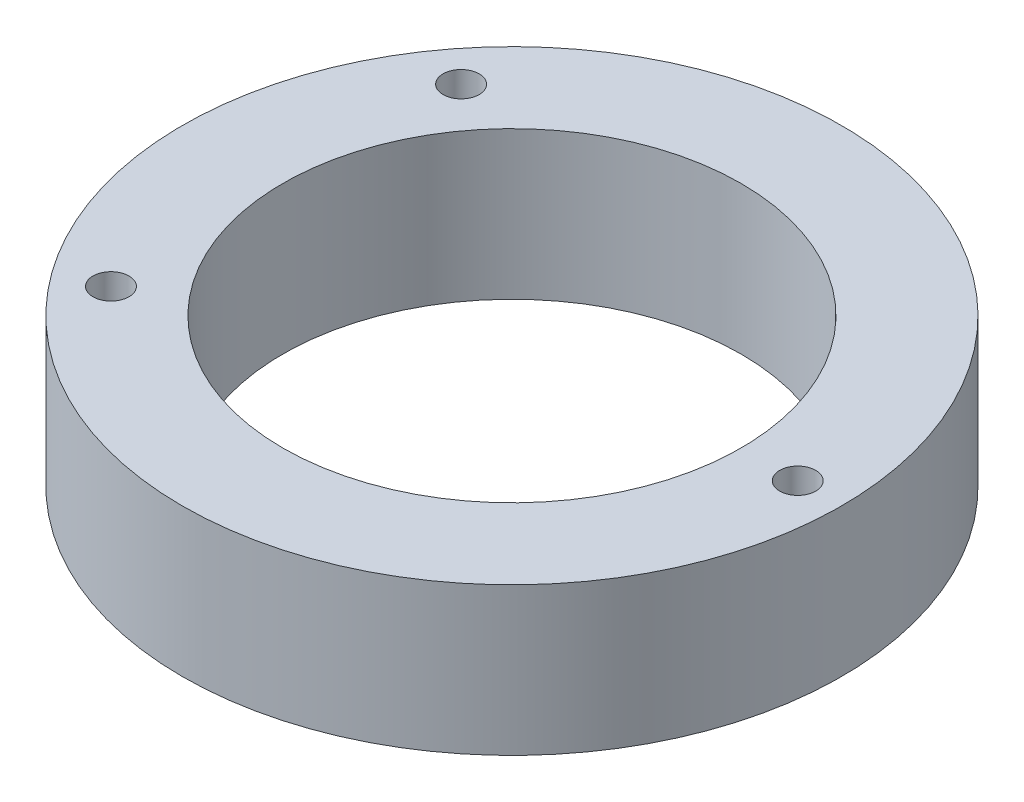
ISO-10303-21;
HEADER;
FILE_DESCRIPTION(('STEP AP214'),'2;1');
FILE_NAME('part.step','',(''),(''),'','','');
FILE_SCHEMA(('AUTOMOTIVE_DESIGN { 1 0 10303 214 1 1 1 1 }'));
ENDSEC;
DATA;
#1=APPLICATION_CONTEXT('core data for automotive mechanical design processes');
#2=APPLICATION_PROTOCOL_DEFINITION('international standard','automotive_design',2000,#1);
#3=PRODUCT_CONTEXT('',#1,'mechanical');
#4=PRODUCT('Part','Part','',(#3));
#5=PRODUCT_RELATED_PRODUCT_CATEGORY('part','',(#4));
#6=PRODUCT_DEFINITION_FORMATION('','',#4);
#7=PRODUCT_DEFINITION_CONTEXT('part definition',#1,'design');
#8=PRODUCT_DEFINITION('design','',#6,#7);
#9=PRODUCT_DEFINITION_SHAPE('','',#8);
#10=(LENGTH_UNIT() NAMED_UNIT(*) SI_UNIT(.MILLI.,.METRE.));
#11=(NAMED_UNIT(*) PLANE_ANGLE_UNIT() SI_UNIT($,.RADIAN.));
#12=(NAMED_UNIT(*) SI_UNIT($,.STERADIAN.) SOLID_ANGLE_UNIT());
#13=UNCERTAINTY_MEASURE_WITH_UNIT(LENGTH_MEASURE(1.E-05),#10,'distance_accuracy_value','');
#14=(GEOMETRIC_REPRESENTATION_CONTEXT(3) GLOBAL_UNCERTAINTY_ASSIGNED_CONTEXT((#13)) GLOBAL_UNIT_ASSIGNED_CONTEXT((#10,
#11,#12)) REPRESENTATION_CONTEXT('',''));
#15=CARTESIAN_POINT('',(0.,0.,0.));
#16=DIRECTION('',(0.,0.,1.));
#17=DIRECTION('',(1.,0.,0.));
#18=AXIS2_PLACEMENT_3D('',#15,#16,#17);
#19=CARTESIAN_POINT('',(0.,14.35,0.));
#20=DIRECTION('',(0.,1.,0.));
#21=DIRECTION('',(0.,0.,1.));
#22=AXIS2_PLACEMENT_3D('',#19,#20,#21);
#23=PLANE('',#22);
#24=CARTESIAN_POINT('',(-21.9327372290304,14.35,17.0005158051837));
#25=DIRECTION('',(0.,1.,0.));
#26=DIRECTION('',(0.,0.,1.));
#27=AXIS2_PLACEMENT_3D('',#24,#25,#26);
#28=CIRCLE('',#27,1.75);
#29=CARTESIAN_POINT('',(-21.9327372290304,14.35,18.7505158051837));
#30=VERTEX_POINT('',#29);
#31=EDGE_CURVE('E53',#30,#30,#28,.T.);
#32=ORIENTED_EDGE('',*,*,#31,.F.);
#33=EDGE_LOOP('',(#32));
#34=FACE_BOUND('',#33,.T.);
#35=CARTESIAN_POINT('',(0.,14.35,0.));
#36=DIRECTION('',(0.,1.,0.));
#37=DIRECTION('',(0.,0.,1.));
#38=AXIS2_PLACEMENT_3D('',#35,#36,#37);
#39=CIRCLE('',#38,22.25);
#40=CARTESIAN_POINT('',(0.,14.35,22.25));
#41=VERTEX_POINT('',#40);
#42=EDGE_CURVE('E42',#41,#41,#39,.T.);
#43=ORIENTED_EDGE('',*,*,#42,.F.);
#44=EDGE_LOOP('',(#43));
#45=FACE_BOUND('',#44,.T.);
#46=CARTESIAN_POINT('',(0.,14.35,0.));
#47=DIRECTION('',(0.,1.,0.));
#48=DIRECTION('',(0.,0.,1.));
#49=AXIS2_PLACEMENT_3D('',#46,#47,#48);
#50=CIRCLE('',#49,32.);
#51=CARTESIAN_POINT('',(0.,14.35,32.));
#52=VERTEX_POINT('',#51);
#53=EDGE_CURVE('E10',#52,#52,#50,.T.);
#54=ORIENTED_EDGE('',*,*,#53,.T.);
#55=EDGE_LOOP('',(#54));
#56=FACE_BOUND('',#55,.T.);
#57=CARTESIAN_POINT('',(27.75,14.35,0.));
#58=DIRECTION('',(0.,1.,0.));
#59=DIRECTION('',(0.,0.,1.));
#60=AXIS2_PLACEMENT_3D('',#57,#58,#59);
#61=CIRCLE('',#60,1.75);
#62=CARTESIAN_POINT('',(27.75,14.35,1.75));
#63=VERTEX_POINT('',#62);
#64=EDGE_CURVE('E47',#63,#63,#61,.T.);
#65=ORIENTED_EDGE('',*,*,#64,.F.);
#66=EDGE_LOOP('',(#65));
#67=FACE_BOUND('',#66,.T.);
#68=CARTESIAN_POINT('',(-21.9327372290304,14.35,-17.0005158051837));
#69=DIRECTION('',(0.,1.,0.));
#70=DIRECTION('',(0.,0.,1.));
#71=AXIS2_PLACEMENT_3D('',#68,#69,#70);
#72=CIRCLE('',#71,1.75);
#73=CARTESIAN_POINT('',(-21.9327372290304,14.35,-15.2505158051838));
#74=VERTEX_POINT('',#73);
#75=EDGE_CURVE('E59',#74,#74,#72,.T.);
#76=ORIENTED_EDGE('',*,*,#75,.F.);
#77=EDGE_LOOP('',(#76));
#78=FACE_BOUND('',#77,.T.);
#79=ADVANCED_FACE('F31',(#34,#45,#56,#67,#78),#23,.T.);
#80=CARTESIAN_POINT('',(0.,0.,0.));
#81=DIRECTION('',(0.,1.,0.));
#82=DIRECTION('',(0.,0.,1.));
#83=AXIS2_PLACEMENT_3D('',#80,#81,#82);
#84=PLANE('',#83);
#85=CARTESIAN_POINT('',(0.,0.,0.));
#86=DIRECTION('',(0.,1.,0.));
#87=DIRECTION('',(0.,0.,1.));
#88=AXIS2_PLACEMENT_3D('',#85,#86,#87);
#89=CIRCLE('',#88,32.);
#90=CARTESIAN_POINT('',(0.,0.,32.));
#91=VERTEX_POINT('',#90);
#92=EDGE_CURVE('E35',#91,#91,#89,.T.);
#93=ORIENTED_EDGE('',*,*,#92,.F.);
#94=EDGE_LOOP('',(#93));
#95=FACE_BOUND('',#94,.T.);
#96=CARTESIAN_POINT('',(0.,0.,0.));
#97=DIRECTION('',(0.,1.,0.));
#98=DIRECTION('',(0.,0.,1.));
#99=AXIS2_PLACEMENT_3D('',#96,#97,#98);
#100=CIRCLE('',#99,22.25);
#101=CARTESIAN_POINT('',(0.,0.,22.25));
#102=VERTEX_POINT('',#101);
#103=EDGE_CURVE('E44',#102,#102,#100,.T.);
#104=ORIENTED_EDGE('',*,*,#103,.T.);
#105=EDGE_LOOP('',(#104));
#106=FACE_BOUND('',#105,.T.);
#107=CARTESIAN_POINT('',(27.75,0.,0.));
#108=DIRECTION('',(0.,1.,0.));
#109=DIRECTION('',(0.,0.,1.));
#110=AXIS2_PLACEMENT_3D('',#107,#108,#109);
#111=CIRCLE('',#110,1.75);
#112=CARTESIAN_POINT('',(27.75,0.,1.75));
#113=VERTEX_POINT('',#112);
#114=EDGE_CURVE('E50',#113,#113,#111,.T.);
#115=ORIENTED_EDGE('',*,*,#114,.T.);
#116=EDGE_LOOP('',(#115));
#117=FACE_BOUND('',#116,.T.);
#118=CARTESIAN_POINT('',(-21.9327372290304,0.,17.0005158051837));
#119=DIRECTION('',(0.,1.,0.));
#120=DIRECTION('',(0.,0.,1.));
#121=AXIS2_PLACEMENT_3D('',#118,#119,#120);
#122=CIRCLE('',#121,1.75);
#123=CARTESIAN_POINT('',(-21.9327372290304,0.,18.7505158051837));
#124=VERTEX_POINT('',#123);
#125=EDGE_CURVE('E56',#124,#124,#122,.T.);
#126=ORIENTED_EDGE('',*,*,#125,.T.);
#127=EDGE_LOOP('',(#126));
#128=FACE_BOUND('',#127,.T.);
#129=CARTESIAN_POINT('',(-21.9327372290304,0.,-17.0005158051837));
#130=DIRECTION('',(0.,1.,0.));
#131=DIRECTION('',(0.,0.,1.));
#132=AXIS2_PLACEMENT_3D('',#129,#130,#131);
#133=CIRCLE('',#132,1.75);
#134=CARTESIAN_POINT('',(-21.9327372290304,0.,-15.2505158051838));
#135=VERTEX_POINT('',#134);
#136=EDGE_CURVE('E62',#135,#135,#133,.T.);
#137=ORIENTED_EDGE('',*,*,#136,.T.);
#138=EDGE_LOOP('',(#137));
#139=FACE_BOUND('',#138,.T.);
#140=ADVANCED_FACE('F72',(#95,#106,#117,#128,#139),#84,.F.);
#141=CARTESIAN_POINT('',(0.,14.35,0.));
#142=DIRECTION('',(0.,-1.,0.));
#143=DIRECTION('',(0.,0.,-1.));
#144=AXIS2_PLACEMENT_3D('',#141,#142,#143);
#145=CYLINDRICAL_SURFACE('',#144,32.);
#146=ORIENTED_EDGE('',*,*,#53,.F.);
#147=EDGE_LOOP('',(#146));
#148=FACE_BOUND('',#147,.T.);
#149=ORIENTED_EDGE('',*,*,#92,.T.);
#150=EDGE_LOOP('',(#149));
#151=FACE_BOUND('',#150,.T.);
#152=ADVANCED_FACE('F33',(#148,#151),#145,.T.);
#153=CARTESIAN_POINT('',(0.,14.35,0.));
#154=DIRECTION('',(0.,-1.,0.));
#155=DIRECTION('',(0.,0.,-1.));
#156=AXIS2_PLACEMENT_3D('',#153,#154,#155);
#157=CYLINDRICAL_SURFACE('',#156,22.25);
#158=ORIENTED_EDGE('',*,*,#42,.T.);
#159=EDGE_LOOP('',(#158));
#160=FACE_BOUND('',#159,.T.);
#161=ORIENTED_EDGE('',*,*,#103,.F.);
#162=EDGE_LOOP('',(#161));
#163=FACE_BOUND('',#162,.T.);
#164=ADVANCED_FACE('F82',(#160,#163),#157,.F.);
#165=CARTESIAN_POINT('',(27.75,14.35,0.));
#166=DIRECTION('',(0.,-1.,0.));
#167=DIRECTION('',(0.,0.,-1.));
#168=AXIS2_PLACEMENT_3D('',#165,#166,#167);
#169=CYLINDRICAL_SURFACE('',#168,1.75);
#170=ORIENTED_EDGE('',*,*,#64,.T.);
#171=EDGE_LOOP('',(#170));
#172=FACE_BOUND('',#171,.T.);
#173=ORIENTED_EDGE('',*,*,#114,.F.);
#174=EDGE_LOOP('',(#173));
#175=FACE_BOUND('',#174,.T.);
#176=ADVANCED_FACE('F85',(#172,#175),#169,.F.);
#177=CARTESIAN_POINT('',(-21.9327372290304,14.35,17.0005158051837));
#178=DIRECTION('',(0.,-1.,0.));
#179=DIRECTION('',(0.,0.,-1.));
#180=AXIS2_PLACEMENT_3D('',#177,#178,#179);
#181=CYLINDRICAL_SURFACE('',#180,1.75);
#182=ORIENTED_EDGE('',*,*,#31,.T.);
#183=EDGE_LOOP('',(#182));
#184=FACE_BOUND('',#183,.T.);
#185=ORIENTED_EDGE('',*,*,#125,.F.);
#186=EDGE_LOOP('',(#185));
#187=FACE_BOUND('',#186,.T.);
#188=ADVANCED_FACE('F89',(#184,#187),#181,.F.);
#189=CARTESIAN_POINT('',(-21.9327372290304,14.35,-17.0005158051837));
#190=DIRECTION('',(0.,-1.,0.));
#191=DIRECTION('',(0.,0.,-1.));
#192=AXIS2_PLACEMENT_3D('',#189,#190,#191);
#193=CYLINDRICAL_SURFACE('',#192,1.75);
#194=ORIENTED_EDGE('',*,*,#75,.T.);
#195=EDGE_LOOP('',(#194));
#196=FACE_BOUND('',#195,.T.);
#197=ORIENTED_EDGE('',*,*,#136,.F.);
#198=EDGE_LOOP('',(#197));
#199=FACE_BOUND('',#198,.T.);
#200=ADVANCED_FACE('F68',(#196,#199),#193,.F.);
#201=CLOSED_SHELL('',(#79,#140,#152,#164,#176,#188,#200));
#202=MANIFOLD_SOLID_BREP('B2',#201);
#203=ADVANCED_BREP_SHAPE_REPRESENTATION('',(#18,#202),#14);
#204=SHAPE_DEFINITION_REPRESENTATION(#9,#203);
ENDSEC;
END-ISO-10303-21;
